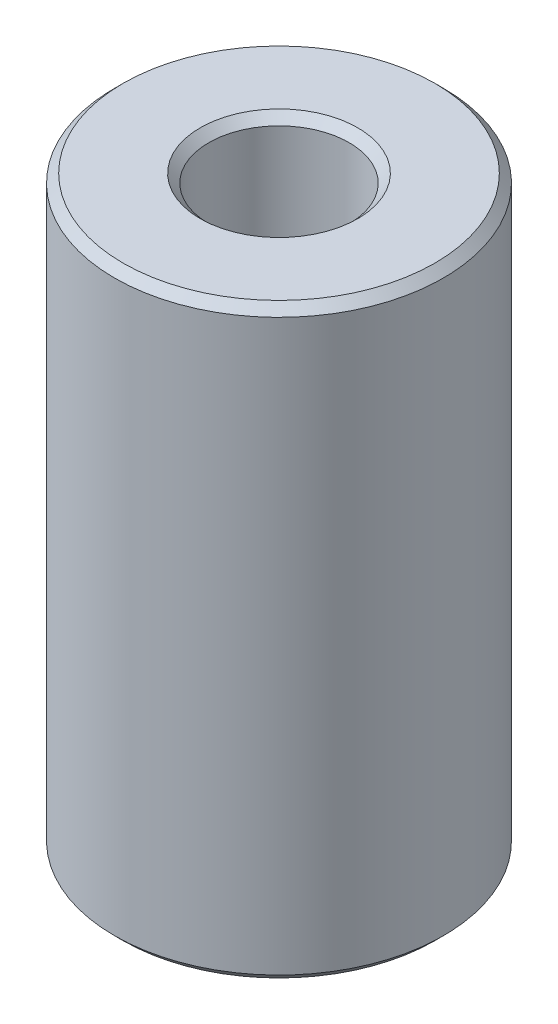
ISO-10303-21;
HEADER;
FILE_DESCRIPTION(('STEP AP214'),'2;1');
FILE_NAME('part.step','',(''),(''),'','','');
FILE_SCHEMA(('AUTOMOTIVE_DESIGN { 1 0 10303 214 1 1 1 1 }'));
ENDSEC;
DATA;
#1=APPLICATION_CONTEXT('core data for automotive mechanical design processes');
#2=APPLICATION_PROTOCOL_DEFINITION('international standard','automotive_design',2000,#1);
#3=PRODUCT_CONTEXT('',#1,'mechanical');
#4=PRODUCT('Part','Part','',(#3));
#5=PRODUCT_RELATED_PRODUCT_CATEGORY('part','',(#4));
#6=PRODUCT_DEFINITION_FORMATION('','',#4);
#7=PRODUCT_DEFINITION_CONTEXT('part definition',#1,'design');
#8=PRODUCT_DEFINITION('design','',#6,#7);
#9=PRODUCT_DEFINITION_SHAPE('','',#8);
#10=(LENGTH_UNIT() NAMED_UNIT(*) SI_UNIT(.MILLI.,.METRE.));
#11=(NAMED_UNIT(*) PLANE_ANGLE_UNIT() SI_UNIT($,.RADIAN.));
#12=(NAMED_UNIT(*) SI_UNIT($,.STERADIAN.) SOLID_ANGLE_UNIT());
#13=UNCERTAINTY_MEASURE_WITH_UNIT(LENGTH_MEASURE(1.E-05),#10,'distance_accuracy_value','');
#14=(GEOMETRIC_REPRESENTATION_CONTEXT(3) GLOBAL_UNCERTAINTY_ASSIGNED_CONTEXT((#13)) GLOBAL_UNIT_ASSIGNED_CONTEXT((#10,
#11,#12)) REPRESENTATION_CONTEXT('',''));
#15=CARTESIAN_POINT('',(0.,0.,0.));
#16=DIRECTION('',(0.,0.,1.));
#17=DIRECTION('',(1.,0.,0.));
#18=AXIS2_PLACEMENT_3D('',#15,#16,#17);
#19=CARTESIAN_POINT('',(0.,115.995001945876,0.));
#20=DIRECTION('',(0.,-1.,0.));
#21=DIRECTION('',(0.,0.,-1.));
#22=AXIS2_PLACEMENT_3D('',#19,#20,#21);
#23=CYLINDRICAL_SURFACE('',#22,32.5);
#24=CARTESIAN_POINT('',(0.,1.69737972211363,0.));
#25=DIRECTION('',(0.,1.,0.));
#26=DIRECTION('',(0.,0.,1.));
#27=AXIS2_PLACEMENT_3D('',#24,#25,#26);
#28=CIRCLE('',#27,32.5);
#29=CARTESIAN_POINT('',(0.,1.69737972211363,32.5));
#30=VERTEX_POINT('',#29);
#31=EDGE_CURVE('E10',#30,#30,#28,.T.);
#32=ORIENTED_EDGE('',*,*,#31,.T.);
#33=EDGE_LOOP('',(#32));
#34=FACE_BOUND('',#33,.T.);
#35=CARTESIAN_POINT('',(0.,114.297622223762,0.));
#36=DIRECTION('',(0.,1.,0.));
#37=DIRECTION('',(0.,0.,1.));
#38=AXIS2_PLACEMENT_3D('',#35,#36,#37);
#39=CIRCLE('',#38,32.5);
#40=CARTESIAN_POINT('',(0.,114.297622223762,-32.5));
#41=VERTEX_POINT('',#40);
#42=EDGE_CURVE('E50',#41,#41,#39,.F.);
#43=ORIENTED_EDGE('',*,*,#42,.T.);
#44=EDGE_LOOP('',(#43));
#45=FACE_BOUND('',#44,.T.);
#46=ADVANCED_FACE('F39',(#34,#45),#23,.T.);
#47=CARTESIAN_POINT('',(0.,115.995001945876,0.));
#48=DIRECTION('',(0.,1.,0.));
#49=DIRECTION('',(0.,0.,1.));
#50=AXIS2_PLACEMENT_3D('',#47,#48,#49);
#51=PLANE('',#50);
#52=CARTESIAN_POINT('',(0.,115.995001945876,0.));
#53=DIRECTION('',(0.,1.,0.));
#54=DIRECTION('',(0.,0.,1.));
#55=AXIS2_PLACEMENT_3D('',#52,#53,#54);
#56=CIRCLE('',#55,15.5734282477055);
#57=CARTESIAN_POINT('',(0.,115.995001945876,15.5734282477055));
#58=VERTEX_POINT('',#57);
#59=EDGE_CURVE('E58',#58,#58,#56,.F.);
#60=ORIENTED_EDGE('',*,*,#59,.T.);
#61=EDGE_LOOP('',(#60));
#62=FACE_BOUND('',#61,.T.);
#63=CARTESIAN_POINT('',(0.,115.995001945876,0.));
#64=DIRECTION('',(0.,1.,0.));
#65=DIRECTION('',(0.,0.,1.));
#66=AXIS2_PLACEMENT_3D('',#63,#64,#65);
#67=CIRCLE('',#66,30.8026202778864);
#68=CARTESIAN_POINT('',(0.,115.995001945876,-30.8026202778864));
#69=VERTEX_POINT('',#68);
#70=EDGE_CURVE('E61',#69,#69,#67,.T.);
#71=ORIENTED_EDGE('',*,*,#70,.T.);
#72=EDGE_LOOP('',(#71));
#73=FACE_BOUND('',#72,.T.);
#74=ADVANCED_FACE('F88',(#62,#73),#51,.T.);
#75=CARTESIAN_POINT('',(0.,0.,0.));
#76=DIRECTION('',(0.,1.,0.));
#77=DIRECTION('',(0.,0.,1.));
#78=AXIS2_PLACEMENT_3D('',#75,#76,#77);
#79=PLANE('',#78);
#80=CARTESIAN_POINT('',(0.,0.,0.));
#81=DIRECTION('',(0.,1.,0.));
#82=DIRECTION('',(0.,0.,1.));
#83=AXIS2_PLACEMENT_3D('',#80,#81,#82);
#84=CIRCLE('',#83,15.5734282477054);
#85=CARTESIAN_POINT('',(0.,0.,15.5734282477054));
#86=VERTEX_POINT('',#85);
#87=EDGE_CURVE('E51',#86,#86,#84,.T.);
#88=ORIENTED_EDGE('',*,*,#87,.T.);
#89=EDGE_LOOP('',(#88));
#90=FACE_BOUND('',#89,.T.);
#91=CARTESIAN_POINT('',(0.,0.,0.));
#92=DIRECTION('',(0.,1.,0.));
#93=DIRECTION('',(0.,0.,1.));
#94=AXIS2_PLACEMENT_3D('',#91,#92,#93);
#95=CIRCLE('',#94,30.8026202778864);
#96=CARTESIAN_POINT('',(0.,0.,30.8026202778864));
#97=VERTEX_POINT('',#96);
#98=EDGE_CURVE('E54',#97,#97,#95,.F.);
#99=ORIENTED_EDGE('',*,*,#98,.T.);
#100=EDGE_LOOP('',(#99));
#101=FACE_BOUND('',#100,.T.);
#102=ADVANCED_FACE('F83',(#90,#101),#79,.F.);
#103=CARTESIAN_POINT('',(0.,115.995001945876,0.));
#104=DIRECTION('',(0.,-1.,0.));
#105=DIRECTION('',(0.,0.,-1.));
#106=AXIS2_PLACEMENT_3D('',#103,#104,#105);
#107=CYLINDRICAL_SURFACE('',#106,13.8760485255918);
#108=CARTESIAN_POINT('',(0.,114.297622223762,0.));
#109=DIRECTION('',(0.,1.,0.));
#110=DIRECTION('',(0.,0.,1.));
#111=AXIS2_PLACEMENT_3D('',#108,#109,#110);
#112=CIRCLE('',#111,13.8760485255918);
#113=CARTESIAN_POINT('',(0.,114.297622223762,13.8760485255918));
#114=VERTEX_POINT('',#113);
#115=EDGE_CURVE('E67',#114,#114,#112,.T.);
#116=ORIENTED_EDGE('',*,*,#115,.T.);
#117=EDGE_LOOP('',(#116));
#118=FACE_BOUND('',#117,.T.);
#119=CARTESIAN_POINT('',(0.,1.69737972211365,0.));
#120=DIRECTION('',(0.,1.,0.));
#121=DIRECTION('',(0.,0.,1.));
#122=AXIS2_PLACEMENT_3D('',#119,#120,#121);
#123=CIRCLE('',#122,13.8760485255918);
#124=CARTESIAN_POINT('',(0.,1.69737972211365,13.8760485255918));
#125=VERTEX_POINT('',#124);
#126=EDGE_CURVE('E69',#125,#125,#123,.F.);
#127=ORIENTED_EDGE('',*,*,#126,.T.);
#128=EDGE_LOOP('',(#127));
#129=FACE_BOUND('',#128,.T.);
#130=ADVANCED_FACE('F71',(#118,#129),#107,.F.);
#131=CARTESIAN_POINT('',(0.,114.297622223762,0.));
#132=DIRECTION('',(0.,1.,0.));
#133=DIRECTION('',(0.,0.,1.));
#134=AXIS2_PLACEMENT_3D('',#131,#132,#133);
#135=CONICAL_SURFACE('',#134,13.8760485255918,0.785398163397446);
#136=ORIENTED_EDGE('',*,*,#59,.F.);
#137=EDGE_LOOP('',(#136));
#138=FACE_BOUND('',#137,.T.);
#139=ORIENTED_EDGE('',*,*,#115,.F.);
#140=EDGE_LOOP('',(#139));
#141=FACE_BOUND('',#140,.T.);
#142=ADVANCED_FACE('F77',(#138,#141),#135,.F.);
#143=CARTESIAN_POINT('',(0.,0.,0.));
#144=DIRECTION('',(0.,-1.,0.));
#145=DIRECTION('',(0.,0.,-1.));
#146=AXIS2_PLACEMENT_3D('',#143,#144,#145);
#147=CONICAL_SURFACE('',#146,15.5734282477054,0.785398163397446);
#148=ORIENTED_EDGE('',*,*,#126,.F.);
#149=EDGE_LOOP('',(#148));
#150=FACE_BOUND('',#149,.T.);
#151=ORIENTED_EDGE('',*,*,#87,.F.);
#152=EDGE_LOOP('',(#151));
#153=FACE_BOUND('',#152,.T.);
#154=ADVANCED_FACE('F73',(#150,#153),#147,.F.);
#155=CARTESIAN_POINT('',(0.,1.69737972211363,0.));
#156=DIRECTION('',(0.,1.,0.));
#157=DIRECTION('',(0.,0.,1.));
#158=AXIS2_PLACEMENT_3D('',#155,#156,#157);
#159=CONICAL_SURFACE('',#158,32.5,0.785398163397452);
#160=ORIENTED_EDGE('',*,*,#98,.F.);
#161=EDGE_LOOP('',(#160));
#162=FACE_BOUND('',#161,.T.);
#163=ORIENTED_EDGE('',*,*,#31,.F.);
#164=EDGE_LOOP('',(#163));
#165=FACE_BOUND('',#164,.T.);
#166=ADVANCED_FACE('F76',(#162,#165),#159,.T.);
#167=CARTESIAN_POINT('',(0.,115.995001945876,0.));
#168=DIRECTION('',(0.,-1.,0.));
#169=DIRECTION('',(0.,0.,-1.));
#170=AXIS2_PLACEMENT_3D('',#167,#168,#169);
#171=CONICAL_SURFACE('',#170,30.8026202778864,0.785398163397448);
#172=CARTESIAN_POINT('',(0.,114.297622223762,-32.5));
#173=CARTESIAN_POINT('',(0.,114.315303262534,-32.482318961228));
#174=CARTESIAN_POINT('',(0.,114.332984301306,-32.464637922456));
#175=CARTESIAN_POINT('',(0.,114.36834637885,-32.4292758449119));
#176=CARTESIAN_POINT('',(0.,114.386027417622,-32.4115948061399));
#177=CARTESIAN_POINT('',(0.,114.421389495166,-32.3762327285959));
#178=CARTESIAN_POINT('',(0.,114.439070533938,-32.3585516898239));
#179=CARTESIAN_POINT('',(0.,114.474432611482,-32.3231896122798));
#180=CARTESIAN_POINT('',(0.,114.492113650254,-32.3055085735078));
#181=CARTESIAN_POINT('',(0.,114.527475727798,-32.2701464959638));
#182=CARTESIAN_POINT('',(0.,114.54515676657,-32.2524654571918));
#183=CARTESIAN_POINT('',(0.,114.580518844114,-32.2171033796477));
#184=CARTESIAN_POINT('',(0.,114.598199882886,-32.1994223408757));
#185=CARTESIAN_POINT('',(0.,114.63356196043,-32.1640602633317));
#186=CARTESIAN_POINT('',(0.,114.651242999202,-32.1463792245597));
#187=CARTESIAN_POINT('',(0.,114.686605076746,-32.1110171470156));
#188=CARTESIAN_POINT('',(0.,114.704286115518,-32.0933361082436));
#189=CARTESIAN_POINT('',(0.,114.739648193063,-32.0579740306996));
#190=CARTESIAN_POINT('',(0.,114.757329231835,-32.0402929919276));
#191=CARTESIAN_POINT('',(0.,114.792691309379,-32.0049309143835));
#192=CARTESIAN_POINT('',(0.,114.810372348151,-31.9872498756115));
#193=CARTESIAN_POINT('',(0.,114.845734425695,-31.9518877980675));
#194=CARTESIAN_POINT('',(0.,114.863415464467,-31.9342067592955));
#195=CARTESIAN_POINT('',(0.,114.898777542011,-31.8988446817514));
#196=CARTESIAN_POINT('',(0.,114.916458580783,-31.8811636429794));
#197=CARTESIAN_POINT('',(0.,114.951820658327,-31.8458015654354));
#198=CARTESIAN_POINT('',(0.,114.969501697099,-31.8281205266634));
#199=CARTESIAN_POINT('',(0.,115.004863774643,-31.7927584491193));
#200=CARTESIAN_POINT('',(0.,115.022544813415,-31.7750774103473));
#201=CARTESIAN_POINT('',(0.,115.057906890959,-31.7397153328033));
#202=CARTESIAN_POINT('',(0.,115.075587929731,-31.7220342940313));
#203=CARTESIAN_POINT('',(0.,115.110950007275,-31.6866722164872));
#204=CARTESIAN_POINT('',(0.,115.128631046047,-31.6689911777152));
#205=CARTESIAN_POINT('',(0.,115.163993123591,-31.6336291001712));
#206=CARTESIAN_POINT('',(0.,115.181674162363,-31.6159480613992));
#207=CARTESIAN_POINT('',(0.,115.217036239907,-31.5805859838551));
#208=CARTESIAN_POINT('',(0.,115.234717278679,-31.5629049450831));
#209=CARTESIAN_POINT('',(0.,115.270079356223,-31.5275428675391));
#210=CARTESIAN_POINT('',(0.,115.287760394995,-31.5098618287671));
#211=CARTESIAN_POINT('',(0.,115.323122472539,-31.474499751223));
#212=CARTESIAN_POINT('',(0.,115.340803511311,-31.456818712451));
#213=CARTESIAN_POINT('',(0.,115.376165588855,-31.421456634907));
#214=CARTESIAN_POINT('',(0.,115.393846627627,-31.403775596135));
#215=CARTESIAN_POINT('',(0.,115.429208705171,-31.3684135185909));
#216=CARTESIAN_POINT('',(0.,115.446889743943,-31.3507324798189));
#217=CARTESIAN_POINT('',(0.,115.482251821487,-31.3153704022749));
#218=CARTESIAN_POINT('',(0.,115.499932860259,-31.2976893635029));
#219=CARTESIAN_POINT('',(0.,115.535294937803,-31.2623272859588));
#220=CARTESIAN_POINT('',(0.,115.552975976575,-31.2446462471868));
#221=CARTESIAN_POINT('',(0.,115.588338054119,-31.2092841696428));
#222=CARTESIAN_POINT('',(0.,115.606019092891,-31.1916031308708));
#223=CARTESIAN_POINT('',(0.,115.641381170435,-31.1562410533267));
#224=CARTESIAN_POINT('',(0.,115.659062209207,-31.1385600145547));
#225=CARTESIAN_POINT('',(0.,115.694424286751,-31.1031979370107));
#226=CARTESIAN_POINT('',(0.,115.712105325523,-31.0855168982387));
#227=CARTESIAN_POINT('',(0.,115.747467403067,-31.0501548206946));
#228=CARTESIAN_POINT('',(0.,115.765148441839,-31.0324737819226));
#229=CARTESIAN_POINT('',(0.,115.800510519384,-30.9971117043786));
#230=CARTESIAN_POINT('',(0.,115.818191558156,-30.9794306656066));
#231=CARTESIAN_POINT('',(0.,115.8535536357,-30.9440685880625));
#232=CARTESIAN_POINT('',(0.,115.871234674472,-30.9263875492905));
#233=CARTESIAN_POINT('',(0.,115.906596752016,-30.8910254717465));
#234=CARTESIAN_POINT('',(0.,115.924277790788,-30.8733444329745));
#235=CARTESIAN_POINT('',(0.,115.959639868332,-30.8379823554304));
#236=CARTESIAN_POINT('',(0.,115.977320907104,-30.8203013166584));
#237=CARTESIAN_POINT('',(0.,115.995001945876,-30.8026202778864));
#238=B_SPLINE_CURVE_WITH_KNOTS('',3,(#172,#173,#174,#175,#176,#177,#178,#179,#180,#181,#182,
#183,#184,#185,#186,#187,#188,#189,#190,#191,#192,#193,#194,#195,#196,#197,#198,#199,#200,#201,
#202,#203,#204,#205,#206,#207,#208,#209,#210,#211,#212,#213,#214,#215,#216,#217,#218,#219,#220,
#221,#222,#223,#224,#225,#226,#227,#228,#229,#230,#231,#232,#233,#234,#235,#236,#237),
.UNSPECIFIED.,.F.,.F.,(4,2,2,2,2,2,2,2,2,2,2,2,2,2,2,2,2,2,2,2,2,2,2,2,2,2,2,2,2,2,2,2,4),(0.,
0.0750142944846862,0.150028588969382,0.225042883454068,0.300057177938769,0.375071472423455,
0.450085766908151,0.525100061392838,0.600114355877533,0.675128650362229,0.750142944846916,
0.825157239331612,0.900171533816298,0.975185828300999,1.05020012278568,1.12521441727038,
1.20022871175508,1.27524300623976,1.35025730072446,1.42527159520915,1.50028588969385,
1.57530018417853,1.65031447866323,1.72532877314791,1.80034306763261,1.87535736211731,
1.95037165660199,2.02538595108669,2.10040024557138,2.17541454005607,2.25042883454076,
2.32544312902546,2.40045742351015),.UNSPECIFIED.);
#239=EDGE_CURVE('BSEAM45',#41,#69,#238,.T.);
#240=ORIENTED_EDGE('',*,*,#42,.F.);
#241=ORIENTED_EDGE('',*,*,#70,.F.);
#242=ORIENTED_EDGE('',*,*,#239,.T.);
#243=ORIENTED_EDGE('',*,*,#239,.F.);
#244=EDGE_LOOP('',(#240,#242,#241,#243));
#245=FACE_BOUND('',#244,.T.);
#246=ADVANCED_FACE('F45',(#245),#171,.T.);
#247=CLOSED_SHELL('',(#46,#74,#102,#130,#142,#154,#166,#246));
#248=MANIFOLD_SOLID_BREP('B2',#247);
#249=ADVANCED_BREP_SHAPE_REPRESENTATION('',(#18,#248),#14);
#250=SHAPE_DEFINITION_REPRESENTATION(#9,#249);
ENDSEC;
END-ISO-10303-21;
